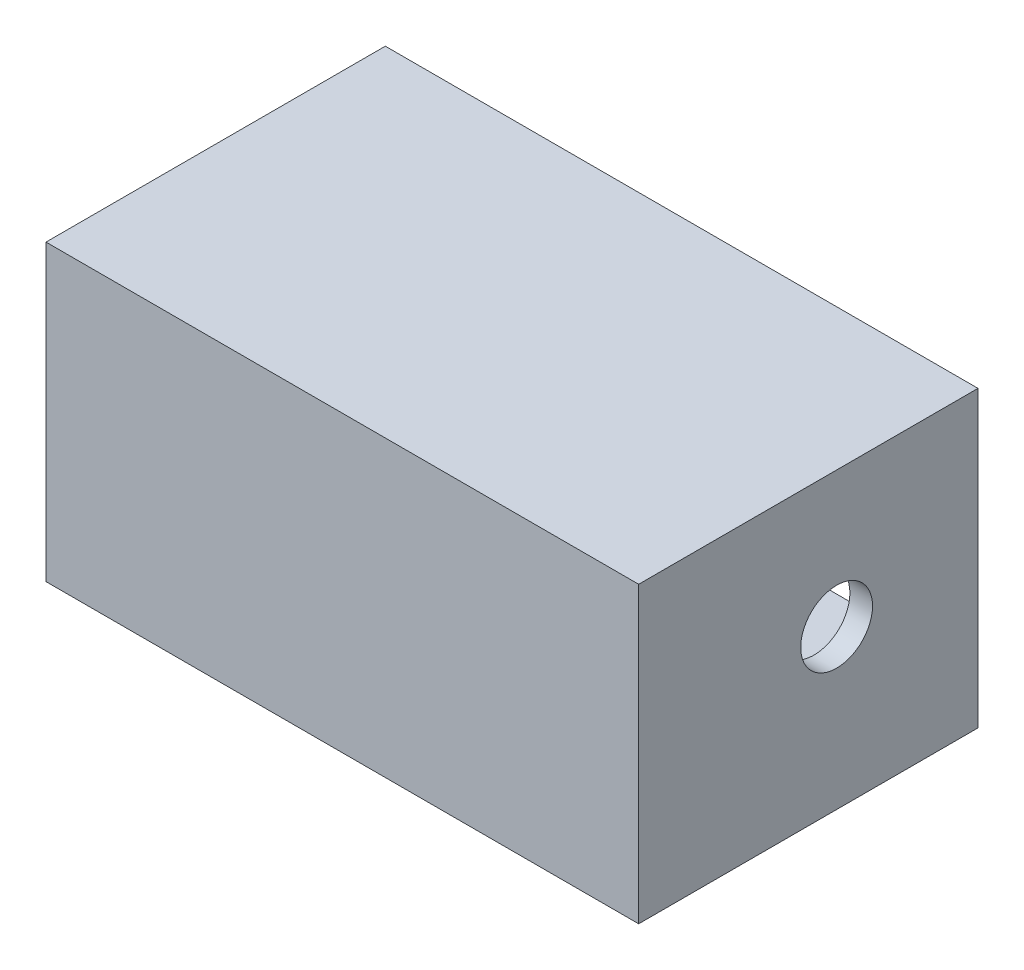
ISO-10303-21;
HEADER;
FILE_DESCRIPTION(('STEP AP214'),'2;1');
FILE_NAME('part.step','',(''),(''),'','','');
FILE_SCHEMA(('AUTOMOTIVE_DESIGN { 1 0 10303 214 1 1 1 1 }'));
ENDSEC;
DATA;
#1=APPLICATION_CONTEXT('core data for automotive mechanical design processes');
#2=APPLICATION_PROTOCOL_DEFINITION('international standard','automotive_design',2000,#1);
#3=PRODUCT_CONTEXT('',#1,'mechanical');
#4=PRODUCT('Part','Part','',(#3));
#5=PRODUCT_RELATED_PRODUCT_CATEGORY('part','',(#4));
#6=PRODUCT_DEFINITION_FORMATION('','',#4);
#7=PRODUCT_DEFINITION_CONTEXT('part definition',#1,'design');
#8=PRODUCT_DEFINITION('design','',#6,#7);
#9=PRODUCT_DEFINITION_SHAPE('','',#8);
#10=(LENGTH_UNIT() NAMED_UNIT(*) SI_UNIT(.MILLI.,.METRE.));
#11=(NAMED_UNIT(*) PLANE_ANGLE_UNIT() SI_UNIT($,.RADIAN.));
#12=(NAMED_UNIT(*) SI_UNIT($,.STERADIAN.) SOLID_ANGLE_UNIT());
#13=UNCERTAINTY_MEASURE_WITH_UNIT(LENGTH_MEASURE(1.E-05),#10,'distance_accuracy_value','');
#14=(GEOMETRIC_REPRESENTATION_CONTEXT(3) GLOBAL_UNCERTAINTY_ASSIGNED_CONTEXT((#13)) GLOBAL_UNIT_ASSIGNED_CONTEXT((#10,
#11,#12)) REPRESENTATION_CONTEXT('',''));
#15=CARTESIAN_POINT('',(0.,0.,0.));
#16=DIRECTION('',(0.,0.,1.));
#17=DIRECTION('',(1.,0.,0.));
#18=AXIS2_PLACEMENT_3D('',#15,#16,#17);
#19=CARTESIAN_POINT('',(0.,20.,0.));
#20=DIRECTION('',(0.,-1.,0.));
#21=DIRECTION('',(0.,0.,-1.));
#22=AXIS2_PLACEMENT_3D('',#19,#20,#21);
#23=PLANE('',#22);
#24=DIRECTION('',(0.,0.,-1.));
#25=VECTOR('',#24,1.);
#26=CARTESIAN_POINT('',(10.,20.,-10.));
#27=LINE('',#26,#25);
#28=CARTESIAN_POINT('',(10.,20.,-10.));
#29=VERTEX_POINT('',#28);
#30=CARTESIAN_POINT('',(10.,20.,-150.));
#31=VERTEX_POINT('',#30);
#32=EDGE_CURVE('E61',#29,#31,#27,.T.);
#33=ORIENTED_EDGE('',*,*,#32,.F.);
#34=DIRECTION('',(-1.,0.,0.));
#35=VECTOR('',#34,1.);
#36=CARTESIAN_POINT('',(10.,20.,-10.));
#37=LINE('',#36,#35);
#38=CARTESIAN_POINT('',(252.,20.,-10.));
#39=VERTEX_POINT('',#38);
#40=EDGE_CURVE('E174',#39,#29,#37,.T.);
#41=ORIENTED_EDGE('',*,*,#40,.F.);
#42=DIRECTION('',(0.,0.,1.));
#43=VECTOR('',#42,1.);
#44=CARTESIAN_POINT('',(252.,20.,-150.));
#45=LINE('',#44,#43);
#46=CARTESIAN_POINT('',(252.,20.,-150.));
#47=VERTEX_POINT('',#46);
#48=EDGE_CURVE('E154',#47,#39,#45,.T.);
#49=ORIENTED_EDGE('',*,*,#48,.F.);
#50=DIRECTION('',(-1.,0.,0.));
#51=VECTOR('',#50,1.);
#52=CARTESIAN_POINT('',(0.,20.,-150.));
#53=LINE('',#52,#51);
#54=EDGE_CURVE('E66',#47,#31,#53,.T.);
#55=ORIENTED_EDGE('',*,*,#54,.T.);
#56=EDGE_LOOP('',(#33,#41,#49,#55));
#57=FACE_BOUND('',#56,.T.);
#58=ADVANCED_FACE('F45',(#57),#23,.F.);
#59=CARTESIAN_POINT('',(0.,20.,0.));
#60=DIRECTION('',(1.,0.,0.));
#61=DIRECTION('',(0.,0.,-1.));
#62=AXIS2_PLACEMENT_3D('',#59,#60,#61);
#63=PLANE('',#62);
#64=CARTESIAN_POINT('',(0.,70.,-87.5));
#65=DIRECTION('',(1.,0.,0.));
#66=DIRECTION('',(0.,0.,-1.));
#67=AXIS2_PLACEMENT_3D('',#64,#65,#66);
#68=CIRCLE('',#67,14.2875);
#69=CARTESIAN_POINT('',(0.,70.,-101.7875));
#70=VERTEX_POINT('',#69);
#71=EDGE_CURVE('E150',#70,#70,#68,.T.);
#72=ORIENTED_EDGE('',*,*,#71,.T.);
#73=EDGE_LOOP('',(#72));
#74=FACE_BOUND('',#73,.T.);
#75=DIRECTION('',(0.,0.,1.));
#76=VECTOR('',#75,1.);
#77=CARTESIAN_POINT('',(0.,0.,0.));
#78=LINE('',#77,#76);
#79=CARTESIAN_POINT('',(0.,0.,-150.));
#80=VERTEX_POINT('',#79);
#81=CARTESIAN_POINT('',(0.,0.,0.));
#82=VERTEX_POINT('',#81);
#83=EDGE_CURVE('E114',#80,#82,#78,.T.);
#84=ORIENTED_EDGE('',*,*,#83,.T.);
#85=DIRECTION('',(0.,-1.,0.));
#86=VECTOR('',#85,1.);
#87=CARTESIAN_POINT('',(0.,20.,0.));
#88=LINE('',#87,#86);
#89=CARTESIAN_POINT('',(0.,130.,0.));
#90=VERTEX_POINT('',#89);
#91=EDGE_CURVE('E11',#90,#82,#88,.T.);
#92=ORIENTED_EDGE('',*,*,#91,.F.);
#93=DIRECTION('',(0.,0.,1.));
#94=VECTOR('',#93,1.);
#95=CARTESIAN_POINT('',(0.,130.,0.));
#96=LINE('',#95,#94);
#97=CARTESIAN_POINT('',(0.,130.,-150.));
#98=VERTEX_POINT('',#97);
#99=EDGE_CURVE('E112',#98,#90,#96,.T.);
#100=ORIENTED_EDGE('',*,*,#99,.F.);
#101=DIRECTION('',(0.,-1.,0.));
#102=VECTOR('',#101,1.);
#103=CARTESIAN_POINT('',(0.,20.,-150.));
#104=LINE('',#103,#102);
#105=EDGE_CURVE('E196',#98,#80,#104,.T.);
#106=ORIENTED_EDGE('',*,*,#105,.T.);
#107=EDGE_LOOP('',(#84,#92,#100,#106));
#108=FACE_BOUND('',#107,.T.);
#109=ADVANCED_FACE('F47',(#74,#108),#63,.F.);
#110=CARTESIAN_POINT('',(0.,20.,0.));
#111=DIRECTION('',(0.,0.,-1.));
#112=DIRECTION('',(-1.,0.,0.));
#113=AXIS2_PLACEMENT_3D('',#110,#111,#112);
#114=PLANE('',#113);
#115=DIRECTION('',(1.,0.,0.));
#116=VECTOR('',#115,1.);
#117=CARTESIAN_POINT('',(0.,0.,0.));
#118=LINE('',#117,#116);
#119=CARTESIAN_POINT('',(262.,0.,0.));
#120=VERTEX_POINT('',#119);
#121=EDGE_CURVE('E200',#82,#120,#118,.T.);
#122=ORIENTED_EDGE('',*,*,#121,.T.);
#123=DIRECTION('',(0.,-1.,0.));
#124=VECTOR('',#123,1.);
#125=CARTESIAN_POINT('',(262.,20.,0.));
#126=LINE('',#125,#124);
#127=CARTESIAN_POINT('',(262.,130.,0.));
#128=VERTEX_POINT('',#127);
#129=EDGE_CURVE('E54',#128,#120,#126,.T.);
#130=ORIENTED_EDGE('',*,*,#129,.F.);
#131=DIRECTION('',(1.,0.,0.));
#132=VECTOR('',#131,1.);
#133=CARTESIAN_POINT('',(0.,130.,0.));
#134=LINE('',#133,#132);
#135=EDGE_CURVE('E117',#90,#128,#134,.T.);
#136=ORIENTED_EDGE('',*,*,#135,.F.);
#137=ORIENTED_EDGE('',*,*,#91,.T.);
#138=EDGE_LOOP('',(#122,#130,#136,#137));
#139=FACE_BOUND('',#138,.T.);
#140=ADVANCED_FACE('F118',(#139),#114,.F.);
#141=CARTESIAN_POINT('',(262.,20.,0.));
#142=DIRECTION('',(-1.,0.,0.));
#143=DIRECTION('',(0.,0.,1.));
#144=AXIS2_PLACEMENT_3D('',#141,#142,#143);
#145=PLANE('',#144);
#146=CARTESIAN_POINT('',(262.,70.,-87.5));
#147=DIRECTION('',(1.,0.,0.));
#148=DIRECTION('',(0.,0.,-1.));
#149=AXIS2_PLACEMENT_3D('',#146,#147,#148);
#150=CIRCLE('',#149,15.875);
#151=CARTESIAN_POINT('',(262.,70.,-103.375));
#152=VERTEX_POINT('',#151);
#153=EDGE_CURVE('E142',#152,#152,#150,.T.);
#154=ORIENTED_EDGE('',*,*,#153,.F.);
#155=EDGE_LOOP('',(#154));
#156=FACE_BOUND('',#155,.T.);
#157=DIRECTION('',(0.,0.,-1.));
#158=VECTOR('',#157,1.);
#159=CARTESIAN_POINT('',(262.,0.,0.));
#160=LINE('',#159,#158);
#161=CARTESIAN_POINT('',(262.,0.,-150.));
#162=VERTEX_POINT('',#161);
#163=EDGE_CURVE('E203',#120,#162,#160,.T.);
#164=ORIENTED_EDGE('',*,*,#163,.T.);
#165=DIRECTION('',(0.,-1.,0.));
#166=VECTOR('',#165,1.);
#167=CARTESIAN_POINT('',(262.,20.,-150.));
#168=LINE('',#167,#166);
#169=CARTESIAN_POINT('',(262.,130.,-150.));
#170=VERTEX_POINT('',#169);
#171=EDGE_CURVE('E210',#170,#162,#168,.T.);
#172=ORIENTED_EDGE('',*,*,#171,.F.);
#173=DIRECTION('',(0.,0.,-1.));
#174=VECTOR('',#173,1.);
#175=CARTESIAN_POINT('',(262.,130.,0.));
#176=LINE('',#175,#174);
#177=EDGE_CURVE('E124',#128,#170,#176,.T.);
#178=ORIENTED_EDGE('',*,*,#177,.F.);
#179=ORIENTED_EDGE('',*,*,#129,.T.);
#180=EDGE_LOOP('',(#164,#172,#178,#179));
#181=FACE_BOUND('',#180,.T.);
#182=ADVANCED_FACE('F216',(#156,#181),#145,.F.);
#183=CARTESIAN_POINT('',(0.,20.,-150.));
#184=DIRECTION('',(0.,0.,1.));
#185=DIRECTION('',(1.,0.,0.));
#186=AXIS2_PLACEMENT_3D('',#183,#184,#185);
#187=PLANE('',#186);
#188=DIRECTION('',(0.,-1.,0.));
#189=VECTOR('',#188,1.);
#190=CARTESIAN_POINT('',(252.,120.,-150.));
#191=LINE('',#190,#189);
#192=CARTESIAN_POINT('',(252.,120.,-150.));
#193=VERTEX_POINT('',#192);
#194=EDGE_CURVE('E190',#193,#47,#191,.T.);
#195=ORIENTED_EDGE('',*,*,#194,.F.);
#196=DIRECTION('',(-1.,0.,0.));
#197=VECTOR('',#196,1.);
#198=CARTESIAN_POINT('',(0.,120.,-150.));
#199=LINE('',#198,#197);
#200=CARTESIAN_POINT('',(10.,120.,-150.));
#201=VERTEX_POINT('',#200);
#202=EDGE_CURVE('E131',#193,#201,#199,.T.);
#203=ORIENTED_EDGE('',*,*,#202,.T.);
#204=DIRECTION('',(0.,-1.,0.));
#205=VECTOR('',#204,1.);
#206=CARTESIAN_POINT('',(10.,120.,-150.));
#207=LINE('',#206,#205);
#208=EDGE_CURVE('E170',#201,#31,#207,.T.);
#209=ORIENTED_EDGE('',*,*,#208,.T.);
#210=ORIENTED_EDGE('',*,*,#54,.F.);
#211=EDGE_LOOP('',(#195,#203,#209,#210));
#212=FACE_BOUND('',#211,.T.);
#213=DIRECTION('',(-1.,0.,0.));
#214=VECTOR('',#213,1.);
#215=CARTESIAN_POINT('',(0.,0.,-150.));
#216=LINE('',#215,#214);
#217=EDGE_CURVE('E197',#162,#80,#216,.T.);
#218=ORIENTED_EDGE('',*,*,#217,.T.);
#219=ORIENTED_EDGE('',*,*,#105,.F.);
#220=DIRECTION('',(-1.,0.,0.));
#221=VECTOR('',#220,1.);
#222=CARTESIAN_POINT('',(0.,130.,-150.));
#223=LINE('',#222,#221);
#224=EDGE_CURVE('E129',#170,#98,#223,.T.);
#225=ORIENTED_EDGE('',*,*,#224,.F.);
#226=ORIENTED_EDGE('',*,*,#171,.T.);
#227=EDGE_LOOP('',(#218,#219,#225,#226));
#228=FACE_BOUND('',#227,.T.);
#229=ADVANCED_FACE('F221',(#212,#228),#187,.F.);
#230=CARTESIAN_POINT('',(0.,0.,0.));
#231=DIRECTION('',(0.,-1.,0.));
#232=DIRECTION('',(0.,0.,-1.));
#233=AXIS2_PLACEMENT_3D('',#230,#231,#232);
#234=PLANE('',#233);
#235=ORIENTED_EDGE('',*,*,#83,.F.);
#236=ORIENTED_EDGE('',*,*,#217,.F.);
#237=ORIENTED_EDGE('',*,*,#163,.F.);
#238=ORIENTED_EDGE('',*,*,#121,.F.);
#239=EDGE_LOOP('',(#235,#236,#237,#238));
#240=FACE_BOUND('',#239,.T.);
#241=ADVANCED_FACE('F219',(#240),#234,.T.);
#242=CARTESIAN_POINT('',(252.,120.,-150.));
#243=DIRECTION('',(1.,0.,0.));
#244=DIRECTION('',(0.,0.,-1.));
#245=AXIS2_PLACEMENT_3D('',#242,#243,#244);
#246=PLANE('',#245);
#247=CARTESIAN_POINT('',(252.,70.,-87.5));
#248=DIRECTION('',(1.,0.,0.));
#249=DIRECTION('',(0.,0.,-1.));
#250=AXIS2_PLACEMENT_3D('',#247,#248,#249);
#251=CIRCLE('',#250,15.875);
#252=CARTESIAN_POINT('',(252.,70.,-103.375));
#253=VERTEX_POINT('',#252);
#254=EDGE_CURVE('E140',#253,#253,#251,.T.);
#255=ORIENTED_EDGE('',*,*,#254,.T.);
#256=EDGE_LOOP('',(#255));
#257=FACE_BOUND('',#256,.T.);
#258=ORIENTED_EDGE('',*,*,#48,.T.);
#259=DIRECTION('',(0.,-1.,0.));
#260=VECTOR('',#259,1.);
#261=CARTESIAN_POINT('',(252.,120.,-10.));
#262=LINE('',#261,#260);
#263=CARTESIAN_POINT('',(252.,120.,-10.));
#264=VERTEX_POINT('',#263);
#265=EDGE_CURVE('E186',#264,#39,#262,.T.);
#266=ORIENTED_EDGE('',*,*,#265,.F.);
#267=DIRECTION('',(0.,0.,1.));
#268=VECTOR('',#267,1.);
#269=CARTESIAN_POINT('',(252.,120.,-150.));
#270=LINE('',#269,#268);
#271=EDGE_CURVE('E158',#193,#264,#270,.T.);
#272=ORIENTED_EDGE('',*,*,#271,.F.);
#273=ORIENTED_EDGE('',*,*,#194,.T.);
#274=EDGE_LOOP('',(#258,#266,#272,#273));
#275=FACE_BOUND('',#274,.T.);
#276=ADVANCED_FACE('F230',(#257,#275),#246,.F.);
#277=CARTESIAN_POINT('',(10.,120.,-10.));
#278=DIRECTION('',(0.,0.,1.));
#279=DIRECTION('',(1.,0.,0.));
#280=AXIS2_PLACEMENT_3D('',#277,#278,#279);
#281=PLANE('',#280);
#282=ORIENTED_EDGE('',*,*,#40,.T.);
#283=DIRECTION('',(0.,-1.,0.));
#284=VECTOR('',#283,1.);
#285=CARTESIAN_POINT('',(10.,120.,-10.));
#286=LINE('',#285,#284);
#287=CARTESIAN_POINT('',(10.,120.,-10.));
#288=VERTEX_POINT('',#287);
#289=EDGE_CURVE('E182',#288,#29,#286,.T.);
#290=ORIENTED_EDGE('',*,*,#289,.F.);
#291=DIRECTION('',(-1.,0.,0.));
#292=VECTOR('',#291,1.);
#293=CARTESIAN_POINT('',(10.,120.,-10.));
#294=LINE('',#293,#292);
#295=EDGE_CURVE('E162',#264,#288,#294,.T.);
#296=ORIENTED_EDGE('',*,*,#295,.F.);
#297=ORIENTED_EDGE('',*,*,#265,.T.);
#298=EDGE_LOOP('',(#282,#290,#296,#297));
#299=FACE_BOUND('',#298,.T.);
#300=ADVANCED_FACE('F243',(#299),#281,.F.);
#301=CARTESIAN_POINT('',(10.,120.,-10.));
#302=DIRECTION('',(-1.,0.,0.));
#303=DIRECTION('',(0.,0.,1.));
#304=AXIS2_PLACEMENT_3D('',#301,#302,#303);
#305=PLANE('',#304);
#306=CARTESIAN_POINT('',(10.,70.,-87.5));
#307=DIRECTION('',(1.,0.,0.));
#308=DIRECTION('',(0.,0.,-1.));
#309=AXIS2_PLACEMENT_3D('',#306,#307,#308);
#310=CIRCLE('',#309,14.2875);
#311=CARTESIAN_POINT('',(10.,70.,-101.7875));
#312=VERTEX_POINT('',#311);
#313=EDGE_CURVE('E146',#312,#312,#310,.T.);
#314=ORIENTED_EDGE('',*,*,#313,.F.);
#315=EDGE_LOOP('',(#314));
#316=FACE_BOUND('',#315,.T.);
#317=ORIENTED_EDGE('',*,*,#32,.T.);
#318=ORIENTED_EDGE('',*,*,#208,.F.);
#319=DIRECTION('',(0.,0.,-1.));
#320=VECTOR('',#319,1.);
#321=CARTESIAN_POINT('',(10.,120.,-10.));
#322=LINE('',#321,#320);
#323=EDGE_CURVE('E166',#288,#201,#322,.T.);
#324=ORIENTED_EDGE('',*,*,#323,.F.);
#325=ORIENTED_EDGE('',*,*,#289,.T.);
#326=EDGE_LOOP('',(#317,#318,#324,#325));
#327=FACE_BOUND('',#326,.T.);
#328=ADVANCED_FACE('F247',(#316,#327),#305,.F.);
#329=CARTESIAN_POINT('',(0.,70.,-87.5));
#330=DIRECTION('',(1.,0.,0.));
#331=DIRECTION('',(0.,0.,-1.));
#332=AXIS2_PLACEMENT_3D('',#329,#330,#331);
#333=CYLINDRICAL_SURFACE('',#332,14.2875);
#334=ORIENTED_EDGE('',*,*,#71,.F.);
#335=EDGE_LOOP('',(#334));
#336=FACE_BOUND('',#335,.T.);
#337=ORIENTED_EDGE('',*,*,#313,.T.);
#338=EDGE_LOOP('',(#337));
#339=FACE_BOUND('',#338,.T.);
#340=ADVANCED_FACE('F251',(#336,#339),#333,.F.);
#341=CARTESIAN_POINT('',(262.,70.,-87.5));
#342=DIRECTION('',(-1.,0.,0.));
#343=DIRECTION('',(0.,0.,1.));
#344=AXIS2_PLACEMENT_3D('',#341,#342,#343);
#345=CYLINDRICAL_SURFACE('',#344,15.875);
#346=ORIENTED_EDGE('',*,*,#153,.T.);
#347=EDGE_LOOP('',(#346));
#348=FACE_BOUND('',#347,.T.);
#349=ORIENTED_EDGE('',*,*,#254,.F.);
#350=EDGE_LOOP('',(#349));
#351=FACE_BOUND('',#350,.T.);
#352=ADVANCED_FACE('F254',(#348,#351),#345,.F.);
#353=CARTESIAN_POINT('',(0.,130.,0.));
#354=DIRECTION('',(0.,-1.,0.));
#355=DIRECTION('',(0.,0.,-1.));
#356=AXIS2_PLACEMENT_3D('',#353,#354,#355);
#357=PLANE('',#356);
#358=ORIENTED_EDGE('',*,*,#99,.T.);
#359=ORIENTED_EDGE('',*,*,#135,.T.);
#360=ORIENTED_EDGE('',*,*,#177,.T.);
#361=ORIENTED_EDGE('',*,*,#224,.T.);
#362=EDGE_LOOP('',(#358,#359,#360,#361));
#363=FACE_BOUND('',#362,.T.);
#364=ADVANCED_FACE('F127',(#363),#357,.F.);
#365=CARTESIAN_POINT('',(0.,120.,0.));
#366=DIRECTION('',(0.,-1.,0.));
#367=DIRECTION('',(0.,0.,-1.));
#368=AXIS2_PLACEMENT_3D('',#365,#366,#367);
#369=PLANE('',#368);
#370=ORIENTED_EDGE('',*,*,#202,.F.);
#371=ORIENTED_EDGE('',*,*,#271,.T.);
#372=ORIENTED_EDGE('',*,*,#295,.T.);
#373=ORIENTED_EDGE('',*,*,#323,.T.);
#374=EDGE_LOOP('',(#370,#371,#372,#373));
#375=FACE_BOUND('',#374,.T.);
#376=ADVANCED_FACE('F259',(#375),#369,.T.);
#377=CLOSED_SHELL('',(#58,#109,#140,#182,#229,#241,#276,#300,#328,#340,#352,#364,#376));
#378=MANIFOLD_SOLID_BREP('B2',#377);
#379=ADVANCED_BREP_SHAPE_REPRESENTATION('',(#18,#378),#14);
#380=SHAPE_DEFINITION_REPRESENTATION(#9,#379);
ENDSEC;
END-ISO-10303-21;
